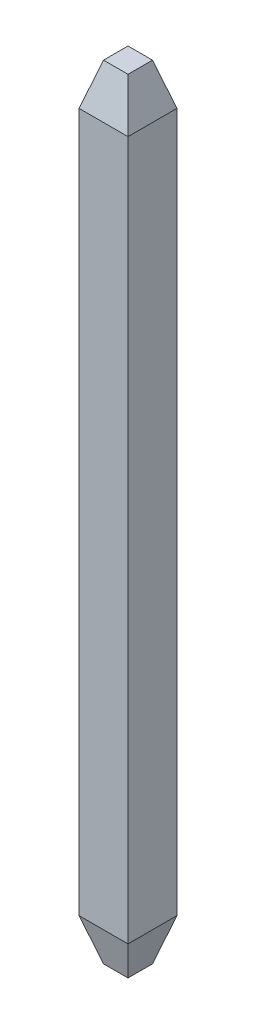
ISO-10303-21;
HEADER;
FILE_DESCRIPTION(('STEP AP214'),'2;1');
FILE_NAME('part.step','',(''),(''),'','','');
FILE_SCHEMA(('AUTOMOTIVE_DESIGN { 1 0 10303 214 1 1 1 1 }'));
ENDSEC;
DATA;
#1=APPLICATION_CONTEXT('core data for automotive mechanical design processes');
#2=APPLICATION_PROTOCOL_DEFINITION('international standard','automotive_design',2000,#1);
#3=PRODUCT_CONTEXT('',#1,'mechanical');
#4=PRODUCT('Part','Part','',(#3));
#5=PRODUCT_RELATED_PRODUCT_CATEGORY('part','',(#4));
#6=PRODUCT_DEFINITION_FORMATION('','',#4);
#7=PRODUCT_DEFINITION_CONTEXT('part definition',#1,'design');
#8=PRODUCT_DEFINITION('design','',#6,#7);
#9=PRODUCT_DEFINITION_SHAPE('','',#8);
#10=(LENGTH_UNIT() NAMED_UNIT(*) SI_UNIT(.MILLI.,.METRE.));
#11=(NAMED_UNIT(*) PLANE_ANGLE_UNIT() SI_UNIT($,.RADIAN.));
#12=(NAMED_UNIT(*) SI_UNIT($,.STERADIAN.) SOLID_ANGLE_UNIT());
#13=UNCERTAINTY_MEASURE_WITH_UNIT(LENGTH_MEASURE(1.E-05),#10,'distance_accuracy_value','');
#14=(GEOMETRIC_REPRESENTATION_CONTEXT(3) GLOBAL_UNCERTAINTY_ASSIGNED_CONTEXT((#13)) GLOBAL_UNIT_ASSIGNED_CONTEXT((#10,
#11,#12)) REPRESENTATION_CONTEXT('',''));
#15=CARTESIAN_POINT('',(0.,0.,0.));
#16=DIRECTION('',(0.,0.,1.));
#17=DIRECTION('',(1.,0.,0.));
#18=AXIS2_PLACEMENT_3D('',#15,#16,#17);
#19=CARTESIAN_POINT('',(-31.909999999987,-5.53543505344803,-19.1989999999763));
#20=DIRECTION('',(-1.,0.,0.));
#21=DIRECTION('',(0.,0.,1.));
#22=AXIS2_PLACEMENT_3D('',#19,#20,#21);
#23=PLANE('',#22);
#24=DIRECTION('',(0.,1.,0.));
#25=VECTOR('',#24,1.);
#26=CARTESIAN_POINT('',(-31.909999999987,-10.1039999999833,-19.8399999999763));
#27=LINE('',#26,#25);
#28=CARTESIAN_POINT('',(-31.909999999987,-10.1039999999833,-19.8399999999763));
#29=VERTEX_POINT('',#28);
#30=CARTESIAN_POINT('',(-31.909999999987,-0.965870106912755,-19.8399999999763));
#31=VERTEX_POINT('',#30);
#32=EDGE_CURVE('E133',#29,#31,#27,.T.);
#33=ORIENTED_EDGE('',*,*,#32,.F.);
#34=DIRECTION('',(0.,0.,-1.));
#35=VECTOR('',#34,1.);
#36=CARTESIAN_POINT('',(-31.909999999987,-10.1039999999833,-19.1999999999763));
#37=LINE('',#36,#35);
#38=CARTESIAN_POINT('',(-31.909999999987,-10.1039999999833,-19.1999999999763));
#39=VERTEX_POINT('',#38);
#40=EDGE_CURVE('E42',#39,#29,#37,.T.);
#41=ORIENTED_EDGE('',*,*,#40,.F.);
#42=DIRECTION('',(0.,1.,0.));
#43=VECTOR('',#42,1.);
#44=CARTESIAN_POINT('',(-31.909999999987,-10.1039999999833,-19.1999999999763));
#45=LINE('',#44,#43);
#46=CARTESIAN_POINT('',(-31.909999999987,-0.965870106912755,-19.1999999999763));
#47=VERTEX_POINT('',#46);
#48=EDGE_CURVE('E11',#39,#47,#45,.T.);
#49=ORIENTED_EDGE('',*,*,#48,.T.);
#50=DIRECTION('',(0.,0.,-1.));
#51=VECTOR('',#50,1.);
#52=CARTESIAN_POINT('',(-31.909999999987,-0.965870106912753,-19.1999999999763));
#53=LINE('',#52,#51);
#54=EDGE_CURVE('E28',#47,#31,#53,.T.);
#55=ORIENTED_EDGE('',*,*,#54,.T.);
#56=EDGE_LOOP('',(#33,#41,#49,#55));
#57=FACE_BOUND('',#56,.T.);
#58=ADVANCED_FACE('F17',(#57),#23,.T.);
#59=CARTESIAN_POINT('',(-31.2689999999869,-5.53443505344803,-19.8399999999763));
#60=DIRECTION('',(0.,0.,-1.));
#61=DIRECTION('',(0.,-1.,0.));
#62=AXIS2_PLACEMENT_3D('',#59,#60,#61);
#63=PLANE('',#62);
#64=DIRECTION('',(0.,1.,0.));
#65=VECTOR('',#64,1.);
#66=CARTESIAN_POINT('',(-31.269999999987,-10.1039999999833,-19.8399999999763));
#67=LINE('',#66,#65);
#68=CARTESIAN_POINT('',(-31.269999999987,-10.1039999999833,-19.8399999999763));
#69=VERTEX_POINT('',#68);
#70=CARTESIAN_POINT('',(-31.269999999987,-0.965870106912755,-19.8399999999763));
#71=VERTEX_POINT('',#70);
#72=EDGE_CURVE('E174',#69,#71,#67,.T.);
#73=ORIENTED_EDGE('',*,*,#72,.F.);
#74=DIRECTION('',(1.,0.,0.));
#75=VECTOR('',#74,1.);
#76=CARTESIAN_POINT('',(-31.909999999987,-10.1039999999833,-19.8399999999763));
#77=LINE('',#76,#75);
#78=EDGE_CURVE('E190',#29,#69,#77,.T.);
#79=ORIENTED_EDGE('',*,*,#78,.F.);
#80=ORIENTED_EDGE('',*,*,#32,.T.);
#81=DIRECTION('',(1.,0.,0.));
#82=VECTOR('',#81,1.);
#83=CARTESIAN_POINT('',(-31.909999999987,-0.965870106912753,-19.8399999999763));
#84=LINE('',#83,#82);
#85=EDGE_CURVE('E137',#31,#71,#84,.T.);
#86=ORIENTED_EDGE('',*,*,#85,.T.);
#87=EDGE_LOOP('',(#73,#79,#80,#86));
#88=FACE_BOUND('',#87,.T.);
#89=ADVANCED_FACE('F239',(#88),#63,.T.);
#90=CARTESIAN_POINT('',(-31.269999999987,-11.0738701069128,-19.5199999999763));
#91=DIRECTION('',(1.,0.,0.));
#92=DIRECTION('',(0.,1.,0.));
#93=AXIS2_PLACEMENT_3D('',#90,#91,#92);
#94=PLANE('',#93);
#95=DIRECTION('',(0.,1.,0.));
#96=VECTOR('',#95,1.);
#97=CARTESIAN_POINT('',(-31.269999999987,-10.1039999999833,-19.1999999999763));
#98=LINE('',#97,#96);
#99=CARTESIAN_POINT('',(-31.269999999987,-10.1039999999833,-19.1999999999763));
#100=VERTEX_POINT('',#99);
#101=CARTESIAN_POINT('',(-31.269999999987,-0.965870106912755,-19.1999999999763));
#102=VERTEX_POINT('',#101);
#103=EDGE_CURVE('E162',#100,#102,#98,.T.);
#104=ORIENTED_EDGE('',*,*,#103,.F.);
#105=DIRECTION('',(0.,0.,1.));
#106=VECTOR('',#105,1.);
#107=CARTESIAN_POINT('',(-31.269999999987,-10.1039999999833,-19.8399999999763));
#108=LINE('',#107,#106);
#109=EDGE_CURVE('E140',#69,#100,#108,.T.);
#110=ORIENTED_EDGE('',*,*,#109,.F.);
#111=ORIENTED_EDGE('',*,*,#72,.T.);
#112=DIRECTION('',(0.,0.,1.));
#113=VECTOR('',#112,1.);
#114=CARTESIAN_POINT('',(-31.269999999987,-0.965870106912753,-19.8399999999763));
#115=LINE('',#114,#113);
#116=EDGE_CURVE('E165',#71,#102,#115,.T.);
#117=ORIENTED_EDGE('',*,*,#116,.T.);
#118=EDGE_LOOP('',(#104,#110,#111,#117));
#119=FACE_BOUND('',#118,.T.);
#120=ADVANCED_FACE('F237',(#119),#94,.T.);
#121=CARTESIAN_POINT('',(-31.269999999987,-0.965870106912753,-19.5199999999763));
#122=DIRECTION('',(0.959644900901017,0.281214622974478,0.));
#123=DIRECTION('',(0.,0.,-1.));
#124=AXIS2_PLACEMENT_3D('',#121,#122,#123);
#125=PLANE('',#124);
#126=DIRECTION('',(-0.270714017147567,0.92381158351666,0.27071401714774));
#127=VECTOR('',#126,1.);
#128=CARTESIAN_POINT('',(-31.269999999987,-0.965870106912753,-19.8399999999763));
#129=LINE('',#128,#127);
#130=CARTESIAN_POINT('',(-31.429999999987,-0.419870106912756,-19.6799999999763));
#131=VERTEX_POINT('',#130);
#132=EDGE_CURVE('E157',#71,#131,#129,.T.);
#133=ORIENTED_EDGE('',*,*,#132,.T.);
#134=DIRECTION('',(0.,0.,1.));
#135=VECTOR('',#134,1.);
#136=CARTESIAN_POINT('',(-31.4299999999869,-0.419870106912754,-19.6799999999763));
#137=LINE('',#136,#135);
#138=CARTESIAN_POINT('',(-31.429999999987,-0.419870106912756,-19.3599999999763));
#139=VERTEX_POINT('',#138);
#140=EDGE_CURVE('E154',#131,#139,#137,.T.);
#141=ORIENTED_EDGE('',*,*,#140,.T.);
#142=DIRECTION('',(-0.270714017147567,0.92381158351666,-0.27071401714774));
#143=VECTOR('',#142,1.);
#144=CARTESIAN_POINT('',(-31.269999999987,-0.965870106912753,-19.1999999999763));
#145=LINE('',#144,#143);
#146=EDGE_CURVE('E158',#102,#139,#145,.T.);
#147=ORIENTED_EDGE('',*,*,#146,.F.);
#148=ORIENTED_EDGE('',*,*,#116,.F.);
#149=EDGE_LOOP('',(#133,#141,#147,#148));
#150=FACE_BOUND('',#149,.T.);
#151=ADVANCED_FACE('F19',(#150),#125,.T.);
#152=CARTESIAN_POINT('',(-31.589999999987,-0.965870106912753,-19.1999999999763));
#153=DIRECTION('',(0.,0.281214622974644,0.959644900900968));
#154=DIRECTION('',(1.,0.,0.));
#155=AXIS2_PLACEMENT_3D('',#152,#153,#154);
#156=PLANE('',#155);
#157=ORIENTED_EDGE('',*,*,#146,.T.);
#158=DIRECTION('',(-1.,0.,0.));
#159=VECTOR('',#158,1.);
#160=CARTESIAN_POINT('',(-31.4299999999869,-0.419870106912754,-19.3599999999763));
#161=LINE('',#160,#159);
#162=CARTESIAN_POINT('',(-31.749999999987,-0.419870106912756,-19.3599999999763));
#163=VERTEX_POINT('',#162);
#164=EDGE_CURVE('E153',#139,#163,#161,.T.);
#165=ORIENTED_EDGE('',*,*,#164,.T.);
#166=DIRECTION('',(0.270714017147727,0.923811583516617,-0.270714017147727));
#167=VECTOR('',#166,1.);
#168=CARTESIAN_POINT('',(-31.909999999987,-0.965870106912753,-19.1999999999763));
#169=LINE('',#168,#167);
#170=EDGE_CURVE('E191',#47,#163,#169,.T.);
#171=ORIENTED_EDGE('',*,*,#170,.F.);
#172=DIRECTION('',(-1.,0.,0.));
#173=VECTOR('',#172,1.);
#174=CARTESIAN_POINT('',(-31.269999999987,-0.965870106912753,-19.1999999999763));
#175=LINE('',#174,#173);
#176=EDGE_CURVE('E128',#102,#47,#175,.T.);
#177=ORIENTED_EDGE('',*,*,#176,.F.);
#178=EDGE_LOOP('',(#157,#165,#171,#177));
#179=FACE_BOUND('',#178,.T.);
#180=ADVANCED_FACE('F227',(#179),#156,.T.);
#181=CARTESIAN_POINT('',(-31.589999999987,-0.419870106912754,-19.6809999999763));
#182=DIRECTION('',(0.,1.,0.));
#183=DIRECTION('',(1.,0.,0.));
#184=AXIS2_PLACEMENT_3D('',#181,#182,#183);
#185=PLANE('',#184);
#186=DIRECTION('',(1.,0.,0.));
#187=VECTOR('',#186,1.);
#188=CARTESIAN_POINT('',(-31.749999999987,-0.419870106912754,-19.6799999999763));
#189=LINE('',#188,#187);
#190=CARTESIAN_POINT('',(-31.749999999987,-0.419870106912756,-19.6799999999763));
#191=VERTEX_POINT('',#190);
#192=EDGE_CURVE('E21',#191,#131,#189,.T.);
#193=ORIENTED_EDGE('',*,*,#192,.F.);
#194=DIRECTION('',(0.,0.,-1.));
#195=VECTOR('',#194,1.);
#196=CARTESIAN_POINT('',(-31.749999999987,-0.419870106912754,-19.3599999999763));
#197=LINE('',#196,#195);
#198=EDGE_CURVE('E198',#163,#191,#197,.T.);
#199=ORIENTED_EDGE('',*,*,#198,.F.);
#200=ORIENTED_EDGE('',*,*,#164,.F.);
#201=ORIENTED_EDGE('',*,*,#140,.F.);
#202=EDGE_LOOP('',(#193,#199,#200,#201));
#203=FACE_BOUND('',#202,.T.);
#204=ADVANCED_FACE('F392',(#203),#185,.T.);
#205=CARTESIAN_POINT('',(-31.269999999987,-10.1039999999833,-19.5199999999763));
#206=DIRECTION('',(0.959644900901017,-0.281214622974477,0.));
#207=DIRECTION('',(0.,0.,-1.));
#208=AXIS2_PLACEMENT_3D('',#205,#206,#207);
#209=PLANE('',#208);
#210=ORIENTED_EDGE('',*,*,#109,.T.);
#211=DIRECTION('',(-0.270714017147566,-0.923811583516661,-0.270714017147739));
#212=VECTOR('',#211,1.);
#213=CARTESIAN_POINT('',(-31.269999999987,-10.1039999999833,-19.1999999999763));
#214=LINE('',#213,#212);
#215=CARTESIAN_POINT('',(-31.429999999987,-10.6499999999833,-19.3599999999763));
#216=VERTEX_POINT('',#215);
#217=EDGE_CURVE('E138',#100,#216,#214,.T.);
#218=ORIENTED_EDGE('',*,*,#217,.T.);
#219=DIRECTION('',(0.,0.,1.));
#220=VECTOR('',#219,1.);
#221=CARTESIAN_POINT('',(-31.4299999999869,-10.6499999999833,-19.6799999999763));
#222=LINE('',#221,#220);
#223=CARTESIAN_POINT('',(-31.429999999987,-10.6499999999833,-19.6799999999763));
#224=VERTEX_POINT('',#223);
#225=EDGE_CURVE('E71',#224,#216,#222,.T.);
#226=ORIENTED_EDGE('',*,*,#225,.F.);
#227=DIRECTION('',(-0.270714017147566,-0.923811583516661,0.270714017147739));
#228=VECTOR('',#227,1.);
#229=CARTESIAN_POINT('',(-31.269999999987,-10.1039999999833,-19.8399999999763));
#230=LINE('',#229,#228);
#231=EDGE_CURVE('E86',#69,#224,#230,.T.);
#232=ORIENTED_EDGE('',*,*,#231,.F.);
#233=EDGE_LOOP('',(#210,#218,#226,#232));
#234=FACE_BOUND('',#233,.T.);
#235=ADVANCED_FACE('F235',(#234),#209,.T.);
#236=CARTESIAN_POINT('',(-31.7509999999869,-10.6499999999833,-19.5199999999763));
#237=DIRECTION('',(0.,-1.,0.));
#238=DIRECTION('',(0.,0.,-1.));
#239=AXIS2_PLACEMENT_3D('',#236,#237,#238);
#240=PLANE('',#239);
#241=ORIENTED_EDGE('',*,*,#225,.T.);
#242=DIRECTION('',(-1.,0.,0.));
#243=VECTOR('',#242,1.);
#244=CARTESIAN_POINT('',(-31.4299999999869,-10.6499999999833,-19.3599999999763));
#245=LINE('',#244,#243);
#246=CARTESIAN_POINT('',(-31.749999999987,-10.6499999999833,-19.3599999999763));
#247=VERTEX_POINT('',#246);
#248=EDGE_CURVE('E117',#216,#247,#245,.T.);
#249=ORIENTED_EDGE('',*,*,#248,.T.);
#250=DIRECTION('',(0.,0.,-1.));
#251=VECTOR('',#250,1.);
#252=CARTESIAN_POINT('',(-31.749999999987,-10.6499999999833,-19.3599999999763));
#253=LINE('',#252,#251);
#254=CARTESIAN_POINT('',(-31.749999999987,-10.6499999999833,-19.6799999999763));
#255=VERTEX_POINT('',#254);
#256=EDGE_CURVE('E112',#247,#255,#253,.T.);
#257=ORIENTED_EDGE('',*,*,#256,.T.);
#258=DIRECTION('',(1.,0.,0.));
#259=VECTOR('',#258,1.);
#260=CARTESIAN_POINT('',(-31.749999999987,-10.6499999999833,-19.6799999999763));
#261=LINE('',#260,#259);
#262=EDGE_CURVE('E107',#255,#224,#261,.T.);
#263=ORIENTED_EDGE('',*,*,#262,.T.);
#264=EDGE_LOOP('',(#241,#249,#257,#263));
#265=FACE_BOUND('',#264,.T.);
#266=ADVANCED_FACE('F115',(#265),#240,.T.);
#267=CARTESIAN_POINT('',(-31.589999999987,-10.1039999999833,-19.1999999999763));
#268=DIRECTION('',(0.,-0.281214622974642,0.959644900900969));
#269=DIRECTION('',(-1.,0.,0.));
#270=AXIS2_PLACEMENT_3D('',#267,#268,#269);
#271=PLANE('',#270);
#272=DIRECTION('',(-1.,0.,0.));
#273=VECTOR('',#272,1.);
#274=CARTESIAN_POINT('',(-31.269999999987,-10.1039999999833,-19.1999999999763));
#275=LINE('',#274,#273);
#276=EDGE_CURVE('E113',#100,#39,#275,.T.);
#277=ORIENTED_EDGE('',*,*,#276,.T.);
#278=DIRECTION('',(0.270714017147726,-0.923811583516618,-0.270714017147726));
#279=VECTOR('',#278,1.);
#280=CARTESIAN_POINT('',(-31.909999999987,-10.1039999999833,-19.1999999999763));
#281=LINE('',#280,#279);
#282=EDGE_CURVE('E145',#39,#247,#281,.T.);
#283=ORIENTED_EDGE('',*,*,#282,.T.);
#284=ORIENTED_EDGE('',*,*,#248,.F.);
#285=ORIENTED_EDGE('',*,*,#217,.F.);
#286=EDGE_LOOP('',(#277,#283,#284,#285));
#287=FACE_BOUND('',#286,.T.);
#288=ADVANCED_FACE('F233',(#287),#271,.T.);
#289=CARTESIAN_POINT('',(-31.589999999987,-0.965870106912753,-19.8399999999763));
#290=DIRECTION('',(0.,0.281214622974644,-0.959644900900968));
#291=DIRECTION('',(-1.,0.,0.));
#292=AXIS2_PLACEMENT_3D('',#289,#290,#291);
#293=PLANE('',#292);
#294=DIRECTION('',(0.270714017147727,0.923811583516617,0.270714017147727));
#295=VECTOR('',#294,1.);
#296=CARTESIAN_POINT('',(-31.909999999987,-0.965870106912753,-19.8399999999763));
#297=LINE('',#296,#295);
#298=EDGE_CURVE('E146',#31,#191,#297,.T.);
#299=ORIENTED_EDGE('',*,*,#298,.T.);
#300=ORIENTED_EDGE('',*,*,#192,.T.);
#301=ORIENTED_EDGE('',*,*,#132,.F.);
#302=ORIENTED_EDGE('',*,*,#85,.F.);
#303=EDGE_LOOP('',(#299,#300,#301,#302));
#304=FACE_BOUND('',#303,.T.);
#305=ADVANCED_FACE('F241',(#304),#293,.T.);
#306=CARTESIAN_POINT('',(-31.589999999987,-10.1039999999833,-19.8399999999763));
#307=DIRECTION('',(0.,-0.281214622974642,-0.959644900900969));
#308=DIRECTION('',(0.,-0.959644900900969,0.281214622974642));
#309=AXIS2_PLACEMENT_3D('',#306,#307,#308);
#310=PLANE('',#309);
#311=ORIENTED_EDGE('',*,*,#78,.T.);
#312=ORIENTED_EDGE('',*,*,#231,.T.);
#313=ORIENTED_EDGE('',*,*,#262,.F.);
#314=DIRECTION('',(0.270714017147726,-0.923811583516618,0.270714017147726));
#315=VECTOR('',#314,1.);
#316=CARTESIAN_POINT('',(-31.909999999987,-10.1039999999833,-19.8399999999763));
#317=LINE('',#316,#315);
#318=EDGE_CURVE('E110',#29,#255,#317,.T.);
#319=ORIENTED_EDGE('',*,*,#318,.F.);
#320=EDGE_LOOP('',(#311,#312,#313,#319));
#321=FACE_BOUND('',#320,.T.);
#322=ADVANCED_FACE('F109',(#321),#310,.T.);
#323=CARTESIAN_POINT('',(-31.909999999987,-0.965870106912753,-19.5199999999763));
#324=DIRECTION('',(-0.959644900900968,0.281214622974644,0.));
#325=DIRECTION('',(0.,0.,1.));
#326=AXIS2_PLACEMENT_3D('',#323,#324,#325);
#327=PLANE('',#326);
#328=ORIENTED_EDGE('',*,*,#170,.T.);
#329=ORIENTED_EDGE('',*,*,#198,.T.);
#330=ORIENTED_EDGE('',*,*,#298,.F.);
#331=ORIENTED_EDGE('',*,*,#54,.F.);
#332=EDGE_LOOP('',(#328,#329,#330,#331));
#333=FACE_BOUND('',#332,.T.);
#334=ADVANCED_FACE('F229',(#333),#327,.T.);
#335=CARTESIAN_POINT('',(-31.9109999999869,-5.53543505344803,-19.1999999999763));
#336=DIRECTION('',(0.,0.,1.));
#337=DIRECTION('',(1.,0.,0.));
#338=AXIS2_PLACEMENT_3D('',#335,#336,#337);
#339=PLANE('',#338);
#340=ORIENTED_EDGE('',*,*,#48,.F.);
#341=ORIENTED_EDGE('',*,*,#276,.F.);
#342=ORIENTED_EDGE('',*,*,#103,.T.);
#343=ORIENTED_EDGE('',*,*,#176,.T.);
#344=EDGE_LOOP('',(#340,#341,#342,#343));
#345=FACE_BOUND('',#344,.T.);
#346=ADVANCED_FACE('F220',(#345),#339,.T.);
#347=CARTESIAN_POINT('',(-31.909999999987,-10.1039999999833,-19.5199999999763));
#348=DIRECTION('',(-0.959644900900969,-0.281214622974642,0.));
#349=DIRECTION('',(-0.281214622974642,0.959644900900969,0.));
#350=AXIS2_PLACEMENT_3D('',#347,#348,#349);
#351=PLANE('',#350);
#352=ORIENTED_EDGE('',*,*,#40,.T.);
#353=ORIENTED_EDGE('',*,*,#318,.T.);
#354=ORIENTED_EDGE('',*,*,#256,.F.);
#355=ORIENTED_EDGE('',*,*,#282,.F.);
#356=EDGE_LOOP('',(#352,#353,#354,#355));
#357=FACE_BOUND('',#356,.T.);
#358=ADVANCED_FACE('F121',(#357),#351,.T.);
#359=CLOSED_SHELL('',(#58,#89,#120,#151,#180,#204,#235,#266,#288,#305,#322,#334,#346,#358));
#360=MANIFOLD_SOLID_BREP('B1',#359);
#361=ADVANCED_BREP_SHAPE_REPRESENTATION('',(#18,#360),#14);
#362=SHAPE_DEFINITION_REPRESENTATION(#9,#361);
ENDSEC;
END-ISO-10303-21;
